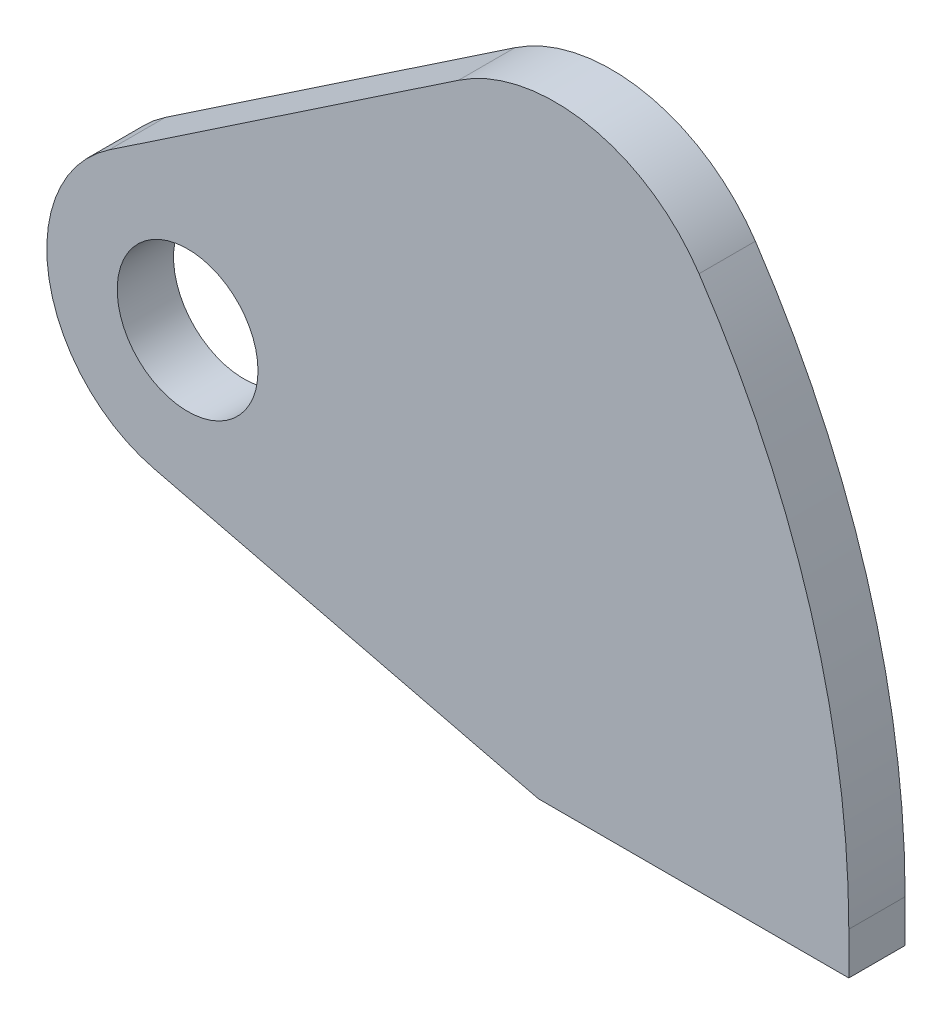
ISO-10303-21;
HEADER;
FILE_DESCRIPTION(('STEP AP214'),'2;1');
FILE_NAME('part.step','',(''),(''),'','','');
FILE_SCHEMA(('AUTOMOTIVE_DESIGN { 1 0 10303 214 1 1 1 1 }'));
ENDSEC;
DATA;
#1=APPLICATION_CONTEXT('core data for automotive mechanical design processes');
#2=APPLICATION_PROTOCOL_DEFINITION('international standard','automotive_design',2000,#1);
#3=PRODUCT_CONTEXT('',#1,'mechanical');
#4=PRODUCT('Part','Part','',(#3));
#5=PRODUCT_RELATED_PRODUCT_CATEGORY('part','',(#4));
#6=PRODUCT_DEFINITION_FORMATION('','',#4);
#7=PRODUCT_DEFINITION_CONTEXT('part definition',#1,'design');
#8=PRODUCT_DEFINITION('design','',#6,#7);
#9=PRODUCT_DEFINITION_SHAPE('','',#8);
#10=(LENGTH_UNIT() NAMED_UNIT(*) SI_UNIT(.MILLI.,.METRE.));
#11=(NAMED_UNIT(*) PLANE_ANGLE_UNIT() SI_UNIT($,.RADIAN.));
#12=(NAMED_UNIT(*) SI_UNIT($,.STERADIAN.) SOLID_ANGLE_UNIT());
#13=UNCERTAINTY_MEASURE_WITH_UNIT(LENGTH_MEASURE(1.E-05),#10,'distance_accuracy_value','');
#14=(GEOMETRIC_REPRESENTATION_CONTEXT(3) GLOBAL_UNCERTAINTY_ASSIGNED_CONTEXT((#13)) GLOBAL_UNIT_ASSIGNED_CONTEXT((#10,
#11,#12)) REPRESENTATION_CONTEXT('',''));
#15=CARTESIAN_POINT('',(0.,0.,0.));
#16=DIRECTION('',(0.,0.,1.));
#17=DIRECTION('',(1.,0.,0.));
#18=AXIS2_PLACEMENT_3D('',#15,#16,#17);
#19=CARTESIAN_POINT('',(-52.2585330504188,0.,4.));
#20=DIRECTION('',(0.,0.,1.));
#21=DIRECTION('',(1.,0.,0.));
#22=AXIS2_PLACEMENT_3D('',#19,#20,#21);
#23=PLANE('',#22);
#24=CARTESIAN_POINT('',(-52.2585330504188,0.,4.));
#25=DIRECTION('',(0.,0.,1.));
#26=DIRECTION('',(1.,0.,0.));
#27=AXIS2_PLACEMENT_3D('',#24,#25,#26);
#28=CIRCLE('',#27,62.9085330504188);
#29=CARTESIAN_POINT('',(10.65,0.,4.));
#30=VERTEX_POINT('',#29);
#31=CARTESIAN_POINT('',(0.0148351376935505,34.9996929818774,4.));
#32=VERTEX_POINT('',#31);
#33=EDGE_CURVE('E139',#30,#32,#28,.T.);
#34=ORIENTED_EDGE('',*,*,#33,.T.);
#35=CARTESIAN_POINT('',(-10.2026069369085,28.158593047695,4.));
#36=DIRECTION('',(0.,0.,1.));
#37=DIRECTION('',(1.,0.,0.));
#38=AXIS2_PLACEMENT_3D('',#35,#36,#37);
#39=CIRCLE('',#38,12.2962096134263);
#40=CARTESIAN_POINT('',(-17.0651074008259,38.3616738687045,4.));
#41=VERTEX_POINT('',#40);
#42=EDGE_CURVE('E92',#32,#41,#39,.T.);
#43=ORIENTED_EDGE('',*,*,#42,.T.);
#44=DIRECTION('',(-0.82977447048956,-0.558098851570016,0.));
#45=VECTOR('',#44,1.);
#46=CARTESIAN_POINT('',(-17.0651074008259,38.3616738687045,4.));
#47=LINE('',#46,#45);
#48=CARTESIAN_POINT('',(-41.8900654385709,21.6646301973498,4.));
#49=VERTEX_POINT('',#48);
#50=EDGE_CURVE('E151',#41,#49,#47,.T.);
#51=ORIENTED_EDGE('',*,*,#50,.T.);
#52=CARTESIAN_POINT('',(-36.3090769228708,13.3668854924542,4.));
#53=DIRECTION('',(0.,0.,1.));
#54=DIRECTION('',(1.,0.,0.));
#55=AXIS2_PLACEMENT_3D('',#52,#53,#54);
#56=CIRCLE('',#55,10.);
#57=CARTESIAN_POINT('',(-38.6779047549338,3.65150311696107,4.));
#58=VERTEX_POINT('',#57);
#59=EDGE_CURVE('E108',#49,#58,#56,.T.);
#60=ORIENTED_EDGE('',*,*,#59,.T.);
#61=DIRECTION('',(0.971538237549317,-0.236882783206307,0.));
#62=VECTOR('',#61,1.);
#63=CARTESIAN_POINT('',(-11.397789552648,-3.,4.));
#64=LINE('',#63,#62);
#65=CARTESIAN_POINT('',(-11.397789552648,-3.,4.));
#66=VERTEX_POINT('',#65);
#67=EDGE_CURVE('E102',#58,#66,#64,.T.);
#68=ORIENTED_EDGE('',*,*,#67,.T.);
#69=DIRECTION('',(1.,0.,0.));
#70=VECTOR('',#69,1.);
#71=CARTESIAN_POINT('',(10.65,-3.,4.));
#72=LINE('',#71,#70);
#73=CARTESIAN_POINT('',(10.65,-3.,4.));
#74=VERTEX_POINT('',#73);
#75=EDGE_CURVE('E106',#66,#74,#72,.T.);
#76=ORIENTED_EDGE('',*,*,#75,.T.);
#77=DIRECTION('',(0.,1.,0.));
#78=VECTOR('',#77,1.);
#79=CARTESIAN_POINT('',(10.65,0.,4.));
#80=LINE('',#79,#78);
#81=EDGE_CURVE('E52',#74,#30,#80,.T.);
#82=ORIENTED_EDGE('',*,*,#81,.T.);
#83=EDGE_LOOP('',(#34,#43,#51,#60,#68,#76,#82));
#84=FACE_BOUND('',#83,.T.);
#85=CARTESIAN_POINT('',(-36.3090769228708,13.3668854924542,4.));
#86=DIRECTION('',(0.,0.,1.));
#87=DIRECTION('',(1.,0.,0.));
#88=AXIS2_PLACEMENT_3D('',#85,#86,#87);
#89=CIRCLE('',#88,5.);
#90=CARTESIAN_POINT('',(-31.3090769228708,13.3668854924542,4.));
#91=VERTEX_POINT('',#90);
#92=EDGE_CURVE('E130',#91,#91,#89,.T.);
#93=ORIENTED_EDGE('',*,*,#92,.F.);
#94=EDGE_LOOP('',(#93));
#95=FACE_BOUND('',#94,.T.);
#96=ADVANCED_FACE('F35',(#84,#95),#23,.T.);
#97=CARTESIAN_POINT('',(-52.2585330504188,0.,0.));
#98=DIRECTION('',(0.,0.,1.));
#99=DIRECTION('',(1.,0.,0.));
#100=AXIS2_PLACEMENT_3D('',#97,#98,#99);
#101=PLANE('',#100);
#102=CARTESIAN_POINT('',(-52.2585330504188,0.,0.));
#103=DIRECTION('',(0.,0.,1.));
#104=DIRECTION('',(1.,0.,0.));
#105=AXIS2_PLACEMENT_3D('',#102,#103,#104);
#106=CIRCLE('',#105,62.9085330504188);
#107=CARTESIAN_POINT('',(10.65,0.,0.));
#108=VERTEX_POINT('',#107);
#109=CARTESIAN_POINT('',(0.0148351376935505,34.9996929818774,0.));
#110=VERTEX_POINT('',#109);
#111=EDGE_CURVE('E126',#108,#110,#106,.T.);
#112=ORIENTED_EDGE('',*,*,#111,.F.);
#113=DIRECTION('',(0.,1.,0.));
#114=VECTOR('',#113,1.);
#115=CARTESIAN_POINT('',(10.65,0.,0.));
#116=LINE('',#115,#114);
#117=CARTESIAN_POINT('',(10.65,-3.,0.));
#118=VERTEX_POINT('',#117);
#119=EDGE_CURVE('E84',#118,#108,#116,.T.);
#120=ORIENTED_EDGE('',*,*,#119,.F.);
#121=DIRECTION('',(1.,0.,0.));
#122=VECTOR('',#121,1.);
#123=CARTESIAN_POINT('',(10.65,-3.,0.));
#124=LINE('',#123,#122);
#125=CARTESIAN_POINT('',(-11.397789552648,-3.,0.));
#126=VERTEX_POINT('',#125);
#127=EDGE_CURVE('E78',#126,#118,#124,.T.);
#128=ORIENTED_EDGE('',*,*,#127,.F.);
#129=DIRECTION('',(0.971538237549317,-0.236882783206307,0.));
#130=VECTOR('',#129,1.);
#131=CARTESIAN_POINT('',(-11.397789552648,-3.,0.));
#132=LINE('',#131,#130);
#133=CARTESIAN_POINT('',(-38.6779047549338,3.65150311696107,0.));
#134=VERTEX_POINT('',#133);
#135=EDGE_CURVE('E116',#134,#126,#132,.T.);
#136=ORIENTED_EDGE('',*,*,#135,.F.);
#137=CARTESIAN_POINT('',(-36.3090769228708,13.3668854924542,0.));
#138=DIRECTION('',(0.,0.,1.));
#139=DIRECTION('',(1.,0.,0.));
#140=AXIS2_PLACEMENT_3D('',#137,#138,#139);
#141=CIRCLE('',#140,10.);
#142=CARTESIAN_POINT('',(-41.8900654385709,21.6646301973498,0.));
#143=VERTEX_POINT('',#142);
#144=EDGE_CURVE('E134',#143,#134,#141,.T.);
#145=ORIENTED_EDGE('',*,*,#144,.F.);
#146=DIRECTION('',(-0.82977447048956,-0.558098851570016,0.));
#147=VECTOR('',#146,1.);
#148=CARTESIAN_POINT('',(-17.0651074008259,38.3616738687045,0.));
#149=LINE('',#148,#147);
#150=CARTESIAN_POINT('',(-17.0651074008259,38.3616738687045,0.));
#151=VERTEX_POINT('',#150);
#152=EDGE_CURVE('E132',#151,#143,#149,.T.);
#153=ORIENTED_EDGE('',*,*,#152,.F.);
#154=CARTESIAN_POINT('',(-10.2026069369085,28.158593047695,0.));
#155=DIRECTION('',(0.,0.,1.));
#156=DIRECTION('',(1.,0.,0.));
#157=AXIS2_PLACEMENT_3D('',#154,#155,#156);
#158=CIRCLE('',#157,12.2962096134263);
#159=EDGE_CURVE('E129',#110,#151,#158,.T.);
#160=ORIENTED_EDGE('',*,*,#159,.F.);
#161=EDGE_LOOP('',(#112,#120,#128,#136,#145,#153,#160));
#162=FACE_BOUND('',#161,.T.);
#163=CARTESIAN_POINT('',(-36.3090769228708,13.3668854924542,0.));
#164=DIRECTION('',(0.,0.,1.));
#165=DIRECTION('',(1.,0.,0.));
#166=AXIS2_PLACEMENT_3D('',#163,#164,#165);
#167=CIRCLE('',#166,5.);
#168=CARTESIAN_POINT('',(-31.3090769228708,13.3668854924542,0.));
#169=VERTEX_POINT('',#168);
#170=EDGE_CURVE('E163',#169,#169,#167,.T.);
#171=ORIENTED_EDGE('',*,*,#170,.T.);
#172=EDGE_LOOP('',(#171));
#173=FACE_BOUND('',#172,.T.);
#174=ADVANCED_FACE('F155',(#162,#173),#101,.F.);
#175=CARTESIAN_POINT('',(-52.2585330504188,0.,4.));
#176=DIRECTION('',(0.,0.,-1.));
#177=DIRECTION('',(-1.,0.,0.));
#178=AXIS2_PLACEMENT_3D('',#175,#176,#177);
#179=CYLINDRICAL_SURFACE('',#178,62.9085330504188);
#180=ORIENTED_EDGE('',*,*,#111,.T.);
#181=DIRECTION('',(0.,0.,-1.));
#182=VECTOR('',#181,1.);
#183=CARTESIAN_POINT('',(0.0148351376935505,34.9996929818774,4.));
#184=LINE('',#183,#182);
#185=EDGE_CURVE('E11',#32,#110,#184,.T.);
#186=ORIENTED_EDGE('',*,*,#185,.F.);
#187=ORIENTED_EDGE('',*,*,#33,.F.);
#188=DIRECTION('',(0.,0.,-1.));
#189=VECTOR('',#188,1.);
#190=CARTESIAN_POINT('',(10.65,0.,4.));
#191=LINE('',#190,#189);
#192=EDGE_CURVE('E122',#30,#108,#191,.T.);
#193=ORIENTED_EDGE('',*,*,#192,.T.);
#194=EDGE_LOOP('',(#180,#186,#187,#193));
#195=FACE_BOUND('',#194,.T.);
#196=ADVANCED_FACE('F37',(#195),#179,.T.);
#197=CARTESIAN_POINT('',(-10.2026069369085,28.158593047695,4.));
#198=DIRECTION('',(0.,0.,-1.));
#199=DIRECTION('',(-1.,0.,0.));
#200=AXIS2_PLACEMENT_3D('',#197,#198,#199);
#201=CYLINDRICAL_SURFACE('',#200,12.2962096134263);
#202=ORIENTED_EDGE('',*,*,#159,.T.);
#203=DIRECTION('',(0.,0.,-1.));
#204=VECTOR('',#203,1.);
#205=CARTESIAN_POINT('',(-17.0651074008259,38.3616738687045,4.));
#206=LINE('',#205,#204);
#207=EDGE_CURVE('E44',#41,#151,#206,.T.);
#208=ORIENTED_EDGE('',*,*,#207,.F.);
#209=ORIENTED_EDGE('',*,*,#42,.F.);
#210=ORIENTED_EDGE('',*,*,#185,.T.);
#211=EDGE_LOOP('',(#202,#208,#209,#210));
#212=FACE_BOUND('',#211,.T.);
#213=ADVANCED_FACE('F189',(#212),#201,.T.);
#214=CARTESIAN_POINT('',(-17.0651074008259,38.3616738687045,4.));
#215=DIRECTION('',(0.558098851570016,-0.82977447048956,0.));
#216=DIRECTION('',(0.82977447048956,0.558098851570016,0.));
#217=AXIS2_PLACEMENT_3D('',#214,#215,#216);
#218=PLANE('',#217);
#219=ORIENTED_EDGE('',*,*,#152,.T.);
#220=DIRECTION('',(0.,0.,-1.));
#221=VECTOR('',#220,1.);
#222=CARTESIAN_POINT('',(-41.8900654385709,21.6646301973498,4.));
#223=LINE('',#222,#221);
#224=EDGE_CURVE('E143',#49,#143,#223,.T.);
#225=ORIENTED_EDGE('',*,*,#224,.F.);
#226=ORIENTED_EDGE('',*,*,#50,.F.);
#227=ORIENTED_EDGE('',*,*,#207,.T.);
#228=EDGE_LOOP('',(#219,#225,#226,#227));
#229=FACE_BOUND('',#228,.T.);
#230=ADVANCED_FACE('F149',(#229),#218,.F.);
#231=CARTESIAN_POINT('',(-36.3090769228708,13.3668854924542,4.));
#232=DIRECTION('',(0.,0.,-1.));
#233=DIRECTION('',(-1.,0.,0.));
#234=AXIS2_PLACEMENT_3D('',#231,#232,#233);
#235=CYLINDRICAL_SURFACE('',#234,10.);
#236=ORIENTED_EDGE('',*,*,#144,.T.);
#237=DIRECTION('',(0.,0.,-1.));
#238=VECTOR('',#237,1.);
#239=CARTESIAN_POINT('',(-38.6779047549338,3.65150311696107,4.));
#240=LINE('',#239,#238);
#241=EDGE_CURVE('E117',#58,#134,#240,.T.);
#242=ORIENTED_EDGE('',*,*,#241,.F.);
#243=ORIENTED_EDGE('',*,*,#59,.F.);
#244=ORIENTED_EDGE('',*,*,#224,.T.);
#245=EDGE_LOOP('',(#236,#242,#243,#244));
#246=FACE_BOUND('',#245,.T.);
#247=ADVANCED_FACE('F158',(#246),#235,.T.);
#248=CARTESIAN_POINT('',(-11.397789552648,-3.,4.));
#249=DIRECTION('',(0.236882783206307,0.971538237549318,0.));
#250=DIRECTION('',(-0.971538237549318,0.236882783206307,0.));
#251=AXIS2_PLACEMENT_3D('',#248,#249,#250);
#252=PLANE('',#251);
#253=ORIENTED_EDGE('',*,*,#135,.T.);
#254=DIRECTION('',(0.,0.,-1.));
#255=VECTOR('',#254,1.);
#256=CARTESIAN_POINT('',(-11.397789552648,-3.,4.));
#257=LINE('',#256,#255);
#258=EDGE_CURVE('E113',#66,#126,#257,.T.);
#259=ORIENTED_EDGE('',*,*,#258,.F.);
#260=ORIENTED_EDGE('',*,*,#67,.F.);
#261=ORIENTED_EDGE('',*,*,#241,.T.);
#262=EDGE_LOOP('',(#253,#259,#260,#261));
#263=FACE_BOUND('',#262,.T.);
#264=ADVANCED_FACE('F114',(#263),#252,.F.);
#265=CARTESIAN_POINT('',(10.65,-3.,4.));
#266=DIRECTION('',(0.,1.,0.));
#267=DIRECTION('',(0.,0.,1.));
#268=AXIS2_PLACEMENT_3D('',#265,#266,#267);
#269=PLANE('',#268);
#270=ORIENTED_EDGE('',*,*,#127,.T.);
#271=DIRECTION('',(0.,0.,-1.));
#272=VECTOR('',#271,1.);
#273=CARTESIAN_POINT('',(10.65,-3.,4.));
#274=LINE('',#273,#272);
#275=EDGE_CURVE('E118',#74,#118,#274,.T.);
#276=ORIENTED_EDGE('',*,*,#275,.F.);
#277=ORIENTED_EDGE('',*,*,#75,.F.);
#278=ORIENTED_EDGE('',*,*,#258,.T.);
#279=EDGE_LOOP('',(#270,#276,#277,#278));
#280=FACE_BOUND('',#279,.T.);
#281=ADVANCED_FACE('F120',(#280),#269,.F.);
#282=CARTESIAN_POINT('',(10.65,0.,4.));
#283=DIRECTION('',(-1.,0.,0.));
#284=DIRECTION('',(0.,-1.,0.));
#285=AXIS2_PLACEMENT_3D('',#282,#283,#284);
#286=PLANE('',#285);
#287=ORIENTED_EDGE('',*,*,#119,.T.);
#288=ORIENTED_EDGE('',*,*,#192,.F.);
#289=ORIENTED_EDGE('',*,*,#81,.F.);
#290=ORIENTED_EDGE('',*,*,#275,.T.);
#291=EDGE_LOOP('',(#287,#288,#289,#290));
#292=FACE_BOUND('',#291,.T.);
#293=ADVANCED_FACE('F179',(#292),#286,.F.);
#294=CARTESIAN_POINT('',(-36.3090769228708,13.3668854924542,4.));
#295=DIRECTION('',(0.,0.,-1.));
#296=DIRECTION('',(-1.,0.,0.));
#297=AXIS2_PLACEMENT_3D('',#294,#295,#296);
#298=CYLINDRICAL_SURFACE('',#297,5.);
#299=ORIENTED_EDGE('',*,*,#92,.T.);
#300=EDGE_LOOP('',(#299));
#301=FACE_BOUND('',#300,.T.);
#302=ORIENTED_EDGE('',*,*,#170,.F.);
#303=EDGE_LOOP('',(#302));
#304=FACE_BOUND('',#303,.T.);
#305=ADVANCED_FACE('F169',(#301,#304),#298,.F.);
#306=CLOSED_SHELL('',(#96,#174,#196,#213,#230,#247,#264,#281,#293,#305));
#307=MANIFOLD_SOLID_BREP('B2',#306);
#308=ADVANCED_BREP_SHAPE_REPRESENTATION('',(#18,#307),#14);
#309=SHAPE_DEFINITION_REPRESENTATION(#9,#308);
ENDSEC;
END-ISO-10303-21;
